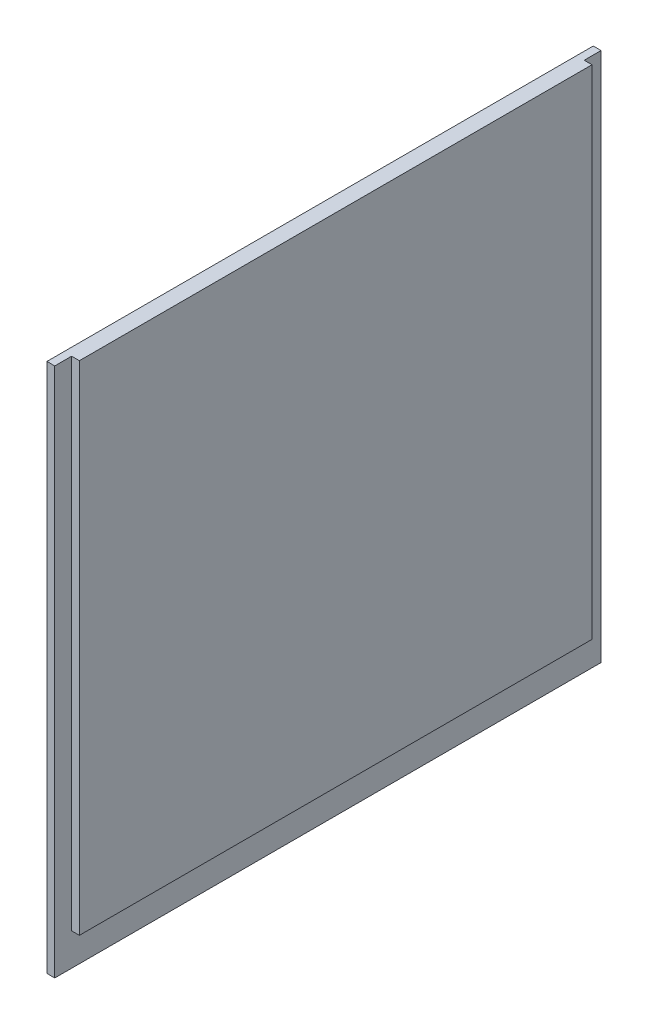
ISO-10303-21;
HEADER;
FILE_DESCRIPTION(('STEP AP214'),'2;1');
FILE_NAME('part.step','',(''),(''),'','','');
FILE_SCHEMA(('AUTOMOTIVE_DESIGN { 1 0 10303 214 1 1 1 1 }'));
ENDSEC;
DATA;
#1=APPLICATION_CONTEXT('core data for automotive mechanical design processes');
#2=APPLICATION_PROTOCOL_DEFINITION('international standard','automotive_design',2000,#1);
#3=PRODUCT_CONTEXT('',#1,'mechanical');
#4=PRODUCT('Part','Part','',(#3));
#5=PRODUCT_RELATED_PRODUCT_CATEGORY('part','',(#4));
#6=PRODUCT_DEFINITION_FORMATION('','',#4);
#7=PRODUCT_DEFINITION_CONTEXT('part definition',#1,'design');
#8=PRODUCT_DEFINITION('design','',#6,#7);
#9=PRODUCT_DEFINITION_SHAPE('','',#8);
#10=(LENGTH_UNIT() NAMED_UNIT(*) SI_UNIT(.MILLI.,.METRE.));
#11=(NAMED_UNIT(*) PLANE_ANGLE_UNIT() SI_UNIT($,.RADIAN.));
#12=(NAMED_UNIT(*) SI_UNIT($,.STERADIAN.) SOLID_ANGLE_UNIT());
#13=UNCERTAINTY_MEASURE_WITH_UNIT(LENGTH_MEASURE(1.E-05),#10,'distance_accuracy_value','');
#14=(GEOMETRIC_REPRESENTATION_CONTEXT(3) GLOBAL_UNCERTAINTY_ASSIGNED_CONTEXT((#13)) GLOBAL_UNIT_ASSIGNED_CONTEXT((#10,
#11,#12)) REPRESENTATION_CONTEXT('',''));
#15=CARTESIAN_POINT('',(0.,0.,0.));
#16=DIRECTION('',(0.,0.,1.));
#17=DIRECTION('',(1.,0.,0.));
#18=AXIS2_PLACEMENT_3D('',#15,#16,#17);
#19=CARTESIAN_POINT('',(1.5875,0.,0.));
#20=DIRECTION('',(-1.,0.,0.));
#21=DIRECTION('',(0.,0.,1.));
#22=AXIS2_PLACEMENT_3D('',#19,#20,#21);
#23=PLANE('',#22);
#24=DIRECTION('',(0.,-1.,0.));
#25=VECTOR('',#24,1.);
#26=CARTESIAN_POINT('',(1.5875,107.95,-3.429));
#27=LINE('',#26,#25);
#28=CARTESIAN_POINT('',(1.5875,107.95,-3.42900000000001));
#29=VERTEX_POINT('',#28);
#30=CARTESIAN_POINT('',(1.5875,6.604,-3.42900000000001));
#31=VERTEX_POINT('',#30);
#32=EDGE_CURVE('E64',#29,#31,#27,.T.);
#33=ORIENTED_EDGE('',*,*,#32,.F.);
#34=DIRECTION('',(0.,0.,1.));
#35=VECTOR('',#34,1.);
#36=CARTESIAN_POINT('',(1.5875,107.95,0.));
#37=LINE('',#36,#35);
#38=CARTESIAN_POINT('',(1.5875,107.95,0.));
#39=VERTEX_POINT('',#38);
#40=EDGE_CURVE('E154',#29,#39,#37,.T.);
#41=ORIENTED_EDGE('',*,*,#40,.T.);
#42=DIRECTION('',(0.,-1.,0.));
#43=VECTOR('',#42,1.);
#44=CARTESIAN_POINT('',(1.5875,0.,0.));
#45=LINE('',#44,#43);
#46=CARTESIAN_POINT('',(1.5875,0.,0.));
#47=VERTEX_POINT('',#46);
#48=EDGE_CURVE('E143',#39,#47,#45,.T.);
#49=ORIENTED_EDGE('',*,*,#48,.T.);
#50=DIRECTION('',(0.,0.,-1.));
#51=VECTOR('',#50,1.);
#52=CARTESIAN_POINT('',(1.5875,0.,0.));
#53=LINE('',#52,#51);
#54=CARTESIAN_POINT('',(1.5875,0.,-111.252));
#55=VERTEX_POINT('',#54);
#56=EDGE_CURVE('E147',#47,#55,#53,.T.);
#57=ORIENTED_EDGE('',*,*,#56,.T.);
#58=DIRECTION('',(0.,1.,0.));
#59=VECTOR('',#58,1.);
#60=CARTESIAN_POINT('',(1.5875,0.,-111.252));
#61=LINE('',#60,#59);
#62=CARTESIAN_POINT('',(1.5875,107.95,-111.252));
#63=VERTEX_POINT('',#62);
#64=EDGE_CURVE('E151',#55,#63,#61,.T.);
#65=ORIENTED_EDGE('',*,*,#64,.T.);
#66=CARTESIAN_POINT('',(1.5875,107.95,-107.823));
#67=VERTEX_POINT('',#66);
#68=EDGE_CURVE('E155',#63,#67,#37,.T.);
#69=ORIENTED_EDGE('',*,*,#68,.T.);
#70=DIRECTION('',(0.,1.,0.));
#71=VECTOR('',#70,1.);
#72=CARTESIAN_POINT('',(1.5875,107.95,-107.823));
#73=LINE('',#72,#71);
#74=CARTESIAN_POINT('',(1.5875,6.604,-107.823));
#75=VERTEX_POINT('',#74);
#76=EDGE_CURVE('E128',#75,#67,#73,.T.);
#77=ORIENTED_EDGE('',*,*,#76,.F.);
#78=DIRECTION('',(0.,0.,-1.));
#79=VECTOR('',#78,1.);
#80=CARTESIAN_POINT('',(1.5875,6.604,-3.42900000000001));
#81=LINE('',#80,#79);
#82=EDGE_CURVE('E59',#31,#75,#81,.T.);
#83=ORIENTED_EDGE('',*,*,#82,.F.);
#84=EDGE_LOOP('',(#33,#41,#49,#57,#65,#69,#77,#83));
#85=FACE_BOUND('',#84,.T.);
#86=ADVANCED_FACE('F43',(#85),#23,.F.);
#87=CARTESIAN_POINT('',(1.5875,0.,0.));
#88=DIRECTION('',(0.,0.,-1.));
#89=DIRECTION('',(-1.,0.,0.));
#90=AXIS2_PLACEMENT_3D('',#87,#88,#89);
#91=PLANE('',#90);
#92=DIRECTION('',(0.,-1.,0.));
#93=VECTOR('',#92,1.);
#94=CARTESIAN_POINT('',(0.,0.,0.));
#95=LINE('',#94,#93);
#96=CARTESIAN_POINT('',(0.,107.95,0.));
#97=VERTEX_POINT('',#96);
#98=CARTESIAN_POINT('',(0.,0.,0.));
#99=VERTEX_POINT('',#98);
#100=EDGE_CURVE('E132',#97,#99,#95,.T.);
#101=ORIENTED_EDGE('',*,*,#100,.T.);
#102=DIRECTION('',(-1.,0.,0.));
#103=VECTOR('',#102,1.);
#104=CARTESIAN_POINT('',(1.5875,0.,0.));
#105=LINE('',#104,#103);
#106=EDGE_CURVE('E11',#47,#99,#105,.T.);
#107=ORIENTED_EDGE('',*,*,#106,.F.);
#108=ORIENTED_EDGE('',*,*,#48,.F.);
#109=DIRECTION('',(-1.,0.,0.));
#110=VECTOR('',#109,1.);
#111=CARTESIAN_POINT('',(1.5875,107.95,0.));
#112=LINE('',#111,#110);
#113=EDGE_CURVE('E157',#39,#97,#112,.T.);
#114=ORIENTED_EDGE('',*,*,#113,.T.);
#115=EDGE_LOOP('',(#101,#107,#108,#114));
#116=FACE_BOUND('',#115,.T.);
#117=ADVANCED_FACE('F45',(#116),#91,.F.);
#118=CARTESIAN_POINT('',(1.5875,0.,0.));
#119=DIRECTION('',(0.,1.,0.));
#120=DIRECTION('',(0.,0.,1.));
#121=AXIS2_PLACEMENT_3D('',#118,#119,#120);
#122=PLANE('',#121);
#123=DIRECTION('',(0.,0.,-1.));
#124=VECTOR('',#123,1.);
#125=CARTESIAN_POINT('',(0.,0.,0.));
#126=LINE('',#125,#124);
#127=CARTESIAN_POINT('',(0.,0.,-111.252));
#128=VERTEX_POINT('',#127);
#129=EDGE_CURVE('E137',#99,#128,#126,.T.);
#130=ORIENTED_EDGE('',*,*,#129,.T.);
#131=DIRECTION('',(-1.,0.,0.));
#132=VECTOR('',#131,1.);
#133=CARTESIAN_POINT('',(1.5875,0.,-111.252));
#134=LINE('',#133,#132);
#135=EDGE_CURVE('E52',#55,#128,#134,.T.);
#136=ORIENTED_EDGE('',*,*,#135,.F.);
#137=ORIENTED_EDGE('',*,*,#56,.F.);
#138=ORIENTED_EDGE('',*,*,#106,.T.);
#139=EDGE_LOOP('',(#130,#136,#137,#138));
#140=FACE_BOUND('',#139,.T.);
#141=ADVANCED_FACE('F225',(#140),#122,.F.);
#142=CARTESIAN_POINT('',(1.5875,0.,-111.252));
#143=DIRECTION('',(0.,0.,1.));
#144=DIRECTION('',(1.,0.,0.));
#145=AXIS2_PLACEMENT_3D('',#142,#143,#144);
#146=PLANE('',#145);
#147=DIRECTION('',(0.,1.,0.));
#148=VECTOR('',#147,1.);
#149=CARTESIAN_POINT('',(0.,0.,-111.252));
#150=LINE('',#149,#148);
#151=CARTESIAN_POINT('',(0.,107.95,-111.252));
#152=VERTEX_POINT('',#151);
#153=EDGE_CURVE('E161',#128,#152,#150,.T.);
#154=ORIENTED_EDGE('',*,*,#153,.T.);
#155=DIRECTION('',(-1.,0.,0.));
#156=VECTOR('',#155,1.);
#157=CARTESIAN_POINT('',(1.5875,107.95,-111.252));
#158=LINE('',#157,#156);
#159=EDGE_CURVE('E169',#63,#152,#158,.T.);
#160=ORIENTED_EDGE('',*,*,#159,.F.);
#161=ORIENTED_EDGE('',*,*,#64,.F.);
#162=ORIENTED_EDGE('',*,*,#135,.T.);
#163=EDGE_LOOP('',(#154,#160,#161,#162));
#164=FACE_BOUND('',#163,.T.);
#165=ADVANCED_FACE('F178',(#164),#146,.F.);
#166=CARTESIAN_POINT('',(1.5875,107.95,0.));
#167=DIRECTION('',(0.,-1.,0.));
#168=DIRECTION('',(0.,0.,-1.));
#169=AXIS2_PLACEMENT_3D('',#166,#167,#168);
#170=PLANE('',#169);
#171=DIRECTION('',(0.,0.,1.));
#172=VECTOR('',#171,1.);
#173=CARTESIAN_POINT('',(0.,107.95,0.));
#174=LINE('',#173,#172);
#175=EDGE_CURVE('E148',#152,#97,#174,.T.);
#176=ORIENTED_EDGE('',*,*,#175,.T.);
#177=ORIENTED_EDGE('',*,*,#113,.F.);
#178=ORIENTED_EDGE('',*,*,#40,.F.);
#179=DIRECTION('',(-1.,0.,0.));
#180=VECTOR('',#179,1.);
#181=CARTESIAN_POINT('',(3.175,107.95,-3.429));
#182=LINE('',#181,#180);
#183=CARTESIAN_POINT('',(3.175,107.95,-3.429));
#184=VERTEX_POINT('',#183);
#185=EDGE_CURVE('E193',#184,#29,#182,.T.);
#186=ORIENTED_EDGE('',*,*,#185,.F.);
#187=DIRECTION('',(0.,0.,1.));
#188=VECTOR('',#187,1.);
#189=CARTESIAN_POINT('',(3.175,107.95,-3.429));
#190=LINE('',#189,#188);
#191=CARTESIAN_POINT('',(3.175,107.95,-107.823));
#192=VERTEX_POINT('',#191);
#193=EDGE_CURVE('E123',#192,#184,#190,.T.);
#194=ORIENTED_EDGE('',*,*,#193,.F.);
#195=DIRECTION('',(-1.,0.,0.));
#196=VECTOR('',#195,1.);
#197=CARTESIAN_POINT('',(3.175,107.95,-107.823));
#198=LINE('',#197,#196);
#199=EDGE_CURVE('E139',#192,#67,#198,.T.);
#200=ORIENTED_EDGE('',*,*,#199,.T.);
#201=ORIENTED_EDGE('',*,*,#68,.F.);
#202=ORIENTED_EDGE('',*,*,#159,.T.);
#203=EDGE_LOOP('',(#176,#177,#178,#186,#194,#200,#201,#202));
#204=FACE_BOUND('',#203,.T.);
#205=ADVANCED_FACE('F187',(#204),#170,.F.);
#206=CARTESIAN_POINT('',(0.,0.,0.));
#207=DIRECTION('',(-1.,0.,0.));
#208=DIRECTION('',(0.,0.,1.));
#209=AXIS2_PLACEMENT_3D('',#206,#207,#208);
#210=PLANE('',#209);
#211=ORIENTED_EDGE('',*,*,#100,.F.);
#212=ORIENTED_EDGE('',*,*,#175,.F.);
#213=ORIENTED_EDGE('',*,*,#153,.F.);
#214=ORIENTED_EDGE('',*,*,#129,.F.);
#215=EDGE_LOOP('',(#211,#212,#213,#214));
#216=FACE_BOUND('',#215,.T.);
#217=ADVANCED_FACE('F184',(#216),#210,.T.);
#218=CARTESIAN_POINT('',(3.175,107.95,-3.429));
#219=DIRECTION('',(0.,0.,-1.));
#220=DIRECTION('',(0.,1.,0.));
#221=AXIS2_PLACEMENT_3D('',#218,#219,#220);
#222=PLANE('',#221);
#223=ORIENTED_EDGE('',*,*,#32,.T.);
#224=DIRECTION('',(-1.,0.,0.));
#225=VECTOR('',#224,1.);
#226=CARTESIAN_POINT('',(3.175,6.604,-3.42900000000001));
#227=LINE('',#226,#225);
#228=CARTESIAN_POINT('',(3.175,6.604,-3.42900000000001));
#229=VERTEX_POINT('',#228);
#230=EDGE_CURVE('E111',#229,#31,#227,.T.);
#231=ORIENTED_EDGE('',*,*,#230,.F.);
#232=DIRECTION('',(0.,-1.,0.));
#233=VECTOR('',#232,1.);
#234=CARTESIAN_POINT('',(3.175,107.95,-3.429));
#235=LINE('',#234,#233);
#236=EDGE_CURVE('E118',#184,#229,#235,.T.);
#237=ORIENTED_EDGE('',*,*,#236,.F.);
#238=ORIENTED_EDGE('',*,*,#185,.T.);
#239=EDGE_LOOP('',(#223,#231,#237,#238));
#240=FACE_BOUND('',#239,.T.);
#241=ADVANCED_FACE('F130',(#240),#222,.F.);
#242=CARTESIAN_POINT('',(3.175,6.604,-3.42900000000001));
#243=DIRECTION('',(0.,1.,0.));
#244=DIRECTION('',(0.,0.,1.));
#245=AXIS2_PLACEMENT_3D('',#242,#243,#244);
#246=PLANE('',#245);
#247=ORIENTED_EDGE('',*,*,#82,.T.);
#248=DIRECTION('',(-1.,0.,0.));
#249=VECTOR('',#248,1.);
#250=CARTESIAN_POINT('',(3.175,6.604,-107.823));
#251=LINE('',#250,#249);
#252=CARTESIAN_POINT('',(3.175,6.604,-107.823));
#253=VERTEX_POINT('',#252);
#254=EDGE_CURVE('E113',#253,#75,#251,.T.);
#255=ORIENTED_EDGE('',*,*,#254,.F.);
#256=DIRECTION('',(0.,0.,-1.));
#257=VECTOR('',#256,1.);
#258=CARTESIAN_POINT('',(3.175,6.604,-3.42900000000001));
#259=LINE('',#258,#257);
#260=EDGE_CURVE('E107',#229,#253,#259,.T.);
#261=ORIENTED_EDGE('',*,*,#260,.F.);
#262=ORIENTED_EDGE('',*,*,#230,.T.);
#263=EDGE_LOOP('',(#247,#255,#261,#262));
#264=FACE_BOUND('',#263,.T.);
#265=ADVANCED_FACE('F109',(#264),#246,.F.);
#266=CARTESIAN_POINT('',(3.175,107.95,-107.823));
#267=DIRECTION('',(0.,0.,1.));
#268=DIRECTION('',(0.,-1.,0.));
#269=AXIS2_PLACEMENT_3D('',#266,#267,#268);
#270=PLANE('',#269);
#271=ORIENTED_EDGE('',*,*,#76,.T.);
#272=ORIENTED_EDGE('',*,*,#199,.F.);
#273=DIRECTION('',(0.,1.,0.));
#274=VECTOR('',#273,1.);
#275=CARTESIAN_POINT('',(3.175,107.95,-107.823));
#276=LINE('',#275,#274);
#277=EDGE_CURVE('E117',#253,#192,#276,.T.);
#278=ORIENTED_EDGE('',*,*,#277,.F.);
#279=ORIENTED_EDGE('',*,*,#254,.T.);
#280=EDGE_LOOP('',(#271,#272,#278,#279));
#281=FACE_BOUND('',#280,.T.);
#282=ADVANCED_FACE('F211',(#281),#270,.F.);
#283=CARTESIAN_POINT('',(3.175,0.,0.));
#284=DIRECTION('',(1.,0.,0.));
#285=DIRECTION('',(0.,0.,-1.));
#286=AXIS2_PLACEMENT_3D('',#283,#284,#285);
#287=PLANE('',#286);
#288=ORIENTED_EDGE('',*,*,#236,.T.);
#289=ORIENTED_EDGE('',*,*,#260,.T.);
#290=ORIENTED_EDGE('',*,*,#277,.T.);
#291=ORIENTED_EDGE('',*,*,#193,.T.);
#292=EDGE_LOOP('',(#288,#289,#290,#291));
#293=FACE_BOUND('',#292,.T.);
#294=ADVANCED_FACE('F121',(#293),#287,.T.);
#295=CLOSED_SHELL('',(#86,#117,#141,#165,#205,#217,#241,#265,#282,#294));
#296=MANIFOLD_SOLID_BREP('B2',#295);
#297=ADVANCED_BREP_SHAPE_REPRESENTATION('',(#18,#296),#14);
#298=SHAPE_DEFINITION_REPRESENTATION(#9,#297);
ENDSEC;
END-ISO-10303-21;
